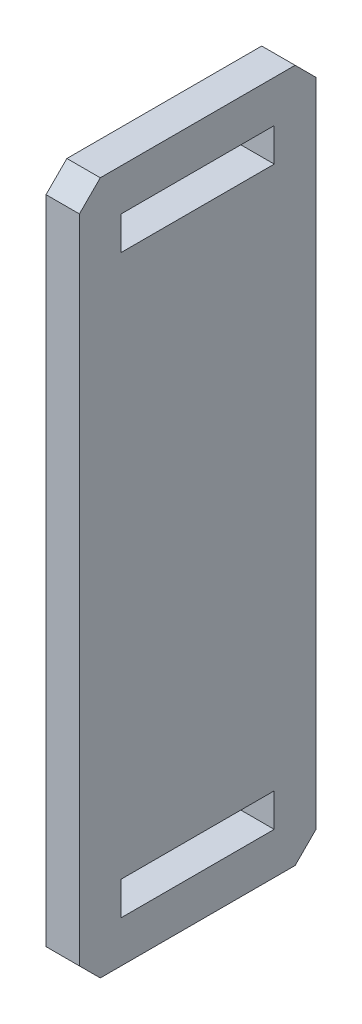
ISO-10303-21;
HEADER;
FILE_DESCRIPTION(('STEP AP214'),'2;1');
FILE_NAME('part.step','',(''),(''),'','','');
FILE_SCHEMA(('AUTOMOTIVE_DESIGN { 1 0 10303 214 1 1 1 1 }'));
ENDSEC;
DATA;
#1=APPLICATION_CONTEXT('core data for automotive mechanical design processes');
#2=APPLICATION_PROTOCOL_DEFINITION('international standard','automotive_design',2000,#1);
#3=PRODUCT_CONTEXT('',#1,'mechanical');
#4=PRODUCT('Part','Part','',(#3));
#5=PRODUCT_RELATED_PRODUCT_CATEGORY('part','',(#4));
#6=PRODUCT_DEFINITION_FORMATION('','',#4);
#7=PRODUCT_DEFINITION_CONTEXT('part definition',#1,'design');
#8=PRODUCT_DEFINITION('design','',#6,#7);
#9=PRODUCT_DEFINITION_SHAPE('','',#8);
#10=(LENGTH_UNIT() NAMED_UNIT(*) SI_UNIT(.MILLI.,.METRE.));
#11=(NAMED_UNIT(*) PLANE_ANGLE_UNIT() SI_UNIT($,.RADIAN.));
#12=(NAMED_UNIT(*) SI_UNIT($,.STERADIAN.) SOLID_ANGLE_UNIT());
#13=UNCERTAINTY_MEASURE_WITH_UNIT(LENGTH_MEASURE(1.E-05),#10,'distance_accuracy_value','');
#14=(GEOMETRIC_REPRESENTATION_CONTEXT(3) GLOBAL_UNCERTAINTY_ASSIGNED_CONTEXT((#13)) GLOBAL_UNIT_ASSIGNED_CONTEXT((#10,
#11,#12)) REPRESENTATION_CONTEXT('',''));
#15=CARTESIAN_POINT('',(0.,0.,0.));
#16=DIRECTION('',(0.,0.,1.));
#17=DIRECTION('',(1.,0.,0.));
#18=AXIS2_PLACEMENT_3D('',#15,#16,#17);
#19=CARTESIAN_POINT('',(3.048,0.,0.));
#20=DIRECTION('',(-1.,0.,0.));
#21=DIRECTION('',(0.,0.,1.));
#22=AXIS2_PLACEMENT_3D('',#19,#20,#21);
#23=PLANE('',#22);
#24=DIRECTION('',(0.,1.,0.));
#25=VECTOR('',#24,1.);
#26=CARTESIAN_POINT('',(3.048,55.626,97.0572928761086));
#27=LINE('',#26,#25);
#28=CARTESIAN_POINT('',(3.048,49.53,97.0572928761086));
#29=VERTEX_POINT('',#28);
#30=CARTESIAN_POINT('',(3.048,55.626,97.0572928761086));
#31=VERTEX_POINT('',#30);
#32=EDGE_CURVE('E190',#29,#31,#27,.T.);
#33=ORIENTED_EDGE('',*,*,#32,.F.);
#34=DIRECTION('',(0.,0.,-1.));
#35=VECTOR('',#34,1.);
#36=CARTESIAN_POINT('',(3.048,49.53,97.0572928761086));
#37=LINE('',#36,#35);
#38=CARTESIAN_POINT('',(3.048,49.53,124.997292876109));
#39=VERTEX_POINT('',#38);
#40=EDGE_CURVE('E198',#39,#29,#37,.T.);
#41=ORIENTED_EDGE('',*,*,#40,.F.);
#42=DIRECTION('',(0.,-1.,0.));
#43=VECTOR('',#42,1.);
#44=CARTESIAN_POINT('',(3.048,55.626,124.997292876109));
#45=LINE('',#44,#43);
#46=CARTESIAN_POINT('',(3.048,55.626,124.997292876109));
#47=VERTEX_POINT('',#46);
#48=EDGE_CURVE('E195',#47,#39,#45,.T.);
#49=ORIENTED_EDGE('',*,*,#48,.F.);
#50=DIRECTION('',(0.,0.,1.));
#51=VECTOR('',#50,1.);
#52=CARTESIAN_POINT('',(3.048,55.626,97.0572928761086));
#53=LINE('',#52,#51);
#54=EDGE_CURVE('E192',#31,#47,#53,.T.);
#55=ORIENTED_EDGE('',*,*,#54,.F.);
#56=EDGE_LOOP('',(#33,#41,#49,#55));
#57=FACE_BOUND('',#56,.T.);
#58=DIRECTION('',(0.,0.,-1.));
#59=VECTOR('',#58,1.);
#60=CARTESIAN_POINT('',(3.048,-63.246,89.4372928761086));
#61=LINE('',#60,#59);
#62=CARTESIAN_POINT('',(3.048,-63.246,128.807292876109));
#63=VERTEX_POINT('',#62);
#64=CARTESIAN_POINT('',(3.048,-63.246,93.2472928761086));
#65=VERTEX_POINT('',#64);
#66=EDGE_CURVE('E229',#63,#65,#61,.T.);
#67=ORIENTED_EDGE('',*,*,#66,.T.);
#68=DIRECTION('',(0.,-0.707106781186546,0.707106781186549));
#69=VECTOR('',#68,1.);
#70=CARTESIAN_POINT('',(3.048,-59.436,89.4372928761086));
#71=LINE('',#70,#69);
#72=CARTESIAN_POINT('',(3.048,-59.436,89.4372928761086));
#73=VERTEX_POINT('',#72);
#74=EDGE_CURVE('E264',#65,#73,#71,.F.);
#75=ORIENTED_EDGE('',*,*,#74,.T.);
#76=DIRECTION('',(0.,1.,0.));
#77=VECTOR('',#76,1.);
#78=CARTESIAN_POINT('',(3.048,63.246,89.4372928761086));
#79=LINE('',#78,#77);
#80=CARTESIAN_POINT('',(3.048,59.436,89.4372928761086));
#81=VERTEX_POINT('',#80);
#82=EDGE_CURVE('E221',#73,#81,#79,.T.);
#83=ORIENTED_EDGE('',*,*,#82,.T.);
#84=DIRECTION('',(0.,-0.707106781186549,-0.707106781186546));
#85=VECTOR('',#84,1.);
#86=CARTESIAN_POINT('',(3.048,63.246,93.2472928761086));
#87=LINE('',#86,#85);
#88=CARTESIAN_POINT('',(3.048,63.246,93.2472928761086));
#89=VERTEX_POINT('',#88);
#90=EDGE_CURVE('E260',#81,#89,#87,.F.);
#91=ORIENTED_EDGE('',*,*,#90,.T.);
#92=DIRECTION('',(0.,0.,1.));
#93=VECTOR('',#92,1.);
#94=CARTESIAN_POINT('',(3.048,63.246,89.4372928761086));
#95=LINE('',#94,#93);
#96=CARTESIAN_POINT('',(3.048,63.246,128.807292876109));
#97=VERTEX_POINT('',#96);
#98=EDGE_CURVE('E224',#89,#97,#95,.T.);
#99=ORIENTED_EDGE('',*,*,#98,.T.);
#100=DIRECTION('',(0.,0.707106781186545,-0.70710678118655));
#101=VECTOR('',#100,1.);
#102=CARTESIAN_POINT('',(3.048,59.436,132.617292876109));
#103=LINE('',#102,#101);
#104=CARTESIAN_POINT('',(3.048,59.436,132.617292876109));
#105=VERTEX_POINT('',#104);
#106=EDGE_CURVE('E55',#97,#105,#103,.F.);
#107=ORIENTED_EDGE('',*,*,#106,.T.);
#108=DIRECTION('',(0.,-1.,0.));
#109=VECTOR('',#108,1.);
#110=CARTESIAN_POINT('',(3.048,63.246,132.617292876109));
#111=LINE('',#110,#109);
#112=CARTESIAN_POINT('',(3.048,-59.436,132.617292876109));
#113=VERTEX_POINT('',#112);
#114=EDGE_CURVE('E227',#105,#113,#111,.T.);
#115=ORIENTED_EDGE('',*,*,#114,.T.);
#116=DIRECTION('',(0.,0.707106781186544,0.707106781186551));
#117=VECTOR('',#116,1.);
#118=CARTESIAN_POINT('',(3.048,-63.246,128.807292876109));
#119=LINE('',#118,#117);
#120=EDGE_CURVE('E262',#113,#63,#119,.F.);
#121=ORIENTED_EDGE('',*,*,#120,.T.);
#122=EDGE_LOOP('',(#67,#75,#83,#91,#99,#107,#115,#121));
#123=FACE_BOUND('',#122,.T.);
#124=DIRECTION('',(0.,1.,0.));
#125=VECTOR('',#124,1.);
#126=CARTESIAN_POINT('',(3.048,-49.53,97.0572928761086));
#127=LINE('',#126,#125);
#128=CARTESIAN_POINT('',(3.048,-55.626,97.0572928761086));
#129=VERTEX_POINT('',#128);
#130=CARTESIAN_POINT('',(3.048,-49.53,97.0572928761086));
#131=VERTEX_POINT('',#130);
#132=EDGE_CURVE('E149',#129,#131,#127,.T.);
#133=ORIENTED_EDGE('',*,*,#132,.F.);
#134=DIRECTION('',(0.,0.,-1.));
#135=VECTOR('',#134,1.);
#136=CARTESIAN_POINT('',(3.048,-55.626,97.0572928761086));
#137=LINE('',#136,#135);
#138=CARTESIAN_POINT('',(3.048,-55.626,124.997292876109));
#139=VERTEX_POINT('',#138);
#140=EDGE_CURVE('E174',#139,#129,#137,.T.);
#141=ORIENTED_EDGE('',*,*,#140,.F.);
#142=DIRECTION('',(0.,-1.,0.));
#143=VECTOR('',#142,1.);
#144=CARTESIAN_POINT('',(3.048,-49.53,124.997292876109));
#145=LINE('',#144,#143);
#146=CARTESIAN_POINT('',(3.048,-49.53,124.997292876109));
#147=VERTEX_POINT('',#146);
#148=EDGE_CURVE('E172',#147,#139,#145,.T.);
#149=ORIENTED_EDGE('',*,*,#148,.F.);
#150=DIRECTION('',(0.,0.,1.));
#151=VECTOR('',#150,1.);
#152=CARTESIAN_POINT('',(3.048,-49.53,97.0572928761086));
#153=LINE('',#152,#151);
#154=EDGE_CURVE('E159',#131,#147,#153,.T.);
#155=ORIENTED_EDGE('',*,*,#154,.F.);
#156=EDGE_LOOP('',(#133,#141,#149,#155));
#157=FACE_BOUND('',#156,.T.);
#158=ADVANCED_FACE('F33',(#57,#123,#157),#23,.F.);
#159=CARTESIAN_POINT('',(-3.048,0.,0.));
#160=DIRECTION('',(-1.,0.,0.));
#161=DIRECTION('',(0.,0.,1.));
#162=AXIS2_PLACEMENT_3D('',#159,#160,#161);
#163=PLANE('',#162);
#164=DIRECTION('',(0.,1.,0.));
#165=VECTOR('',#164,1.);
#166=CARTESIAN_POINT('',(-3.048,63.246,89.4372928761086));
#167=LINE('',#166,#165);
#168=CARTESIAN_POINT('',(-3.048,-59.436,89.4372928761086));
#169=VERTEX_POINT('',#168);
#170=CARTESIAN_POINT('',(-3.048,59.436,89.4372928761086));
#171=VERTEX_POINT('',#170);
#172=EDGE_CURVE('E220',#169,#171,#167,.T.);
#173=ORIENTED_EDGE('',*,*,#172,.F.);
#174=DIRECTION('',(0.,0.707106781186546,-0.707106781186549));
#175=VECTOR('',#174,1.);
#176=CARTESIAN_POINT('',(-3.048,15.0006464380542,15.0006464380541));
#177=LINE('',#176,#175);
#178=CARTESIAN_POINT('',(-3.048,-63.246,93.2472928761086));
#179=VERTEX_POINT('',#178);
#180=EDGE_CURVE('E252',#169,#179,#177,.F.);
#181=ORIENTED_EDGE('',*,*,#180,.T.);
#182=DIRECTION('',(0.,0.,-1.));
#183=VECTOR('',#182,1.);
#184=CARTESIAN_POINT('',(-3.048,-63.246,89.4372928761086));
#185=LINE('',#184,#183);
#186=CARTESIAN_POINT('',(-3.048,-63.246,128.807292876109));
#187=VERTEX_POINT('',#186);
#188=EDGE_CURVE('E225',#187,#179,#185,.T.);
#189=ORIENTED_EDGE('',*,*,#188,.F.);
#190=DIRECTION('',(0.,-0.707106781186544,-0.707106781186551));
#191=VECTOR('',#190,1.);
#192=CARTESIAN_POINT('',(-3.048,-96.0266464380547,96.0266464380536));
#193=LINE('',#192,#191);
#194=CARTESIAN_POINT('',(-3.048,-59.436,132.617292876109));
#195=VERTEX_POINT('',#194);
#196=EDGE_CURVE('E250',#187,#195,#193,.F.);
#197=ORIENTED_EDGE('',*,*,#196,.T.);
#198=DIRECTION('',(0.,-1.,0.));
#199=VECTOR('',#198,1.);
#200=CARTESIAN_POINT('',(-3.048,63.246,132.617292876109));
#201=LINE('',#200,#199);
#202=CARTESIAN_POINT('',(-3.048,59.436,132.617292876109));
#203=VERTEX_POINT('',#202);
#204=EDGE_CURVE('E238',#203,#195,#201,.T.);
#205=ORIENTED_EDGE('',*,*,#204,.F.);
#206=DIRECTION('',(0.,-0.707106781186545,0.70710678118655));
#207=VECTOR('',#206,1.);
#208=CARTESIAN_POINT('',(-3.048,96.0266464380545,96.0266464380538));
#209=LINE('',#208,#207);
#210=CARTESIAN_POINT('',(-3.048,63.246,128.807292876109));
#211=VERTEX_POINT('',#210);
#212=EDGE_CURVE('E246',#203,#211,#209,.F.);
#213=ORIENTED_EDGE('',*,*,#212,.T.);
#214=DIRECTION('',(0.,0.,1.));
#215=VECTOR('',#214,1.);
#216=CARTESIAN_POINT('',(-3.048,63.246,89.4372928761086));
#217=LINE('',#216,#215);
#218=CARTESIAN_POINT('',(-3.048,63.246,93.2472928761086));
#219=VERTEX_POINT('',#218);
#220=EDGE_CURVE('E235',#219,#211,#217,.T.);
#221=ORIENTED_EDGE('',*,*,#220,.F.);
#222=DIRECTION('',(0.,0.707106781186549,0.707106781186546));
#223=VECTOR('',#222,1.);
#224=CARTESIAN_POINT('',(-3.048,-15.0006464380545,15.0006464380546));
#225=LINE('',#224,#223);
#226=EDGE_CURVE('E248',#219,#171,#225,.F.);
#227=ORIENTED_EDGE('',*,*,#226,.T.);
#228=EDGE_LOOP('',(#173,#181,#189,#197,#205,#213,#221,#227));
#229=FACE_BOUND('',#228,.T.);
#230=DIRECTION('',(0.,0.,-1.));
#231=VECTOR('',#230,1.);
#232=CARTESIAN_POINT('',(-3.048,49.53,97.0572928761086));
#233=LINE('',#232,#231);
#234=CARTESIAN_POINT('',(-3.048,49.53,124.997292876109));
#235=VERTEX_POINT('',#234);
#236=CARTESIAN_POINT('',(-3.048,49.53,97.0572928761086));
#237=VERTEX_POINT('',#236);
#238=EDGE_CURVE('E193',#235,#237,#233,.T.);
#239=ORIENTED_EDGE('',*,*,#238,.T.);
#240=DIRECTION('',(0.,1.,0.));
#241=VECTOR('',#240,1.);
#242=CARTESIAN_POINT('',(-3.048,55.626,97.0572928761086));
#243=LINE('',#242,#241);
#244=CARTESIAN_POINT('',(-3.048,55.626,97.0572928761086));
#245=VERTEX_POINT('',#244);
#246=EDGE_CURVE('E167',#237,#245,#243,.T.);
#247=ORIENTED_EDGE('',*,*,#246,.T.);
#248=DIRECTION('',(0.,0.,1.));
#249=VECTOR('',#248,1.);
#250=CARTESIAN_POINT('',(-3.048,55.626,97.0572928761086));
#251=LINE('',#250,#249);
#252=CARTESIAN_POINT('',(-3.048,55.626,124.997292876109));
#253=VERTEX_POINT('',#252);
#254=EDGE_CURVE('E203',#245,#253,#251,.T.);
#255=ORIENTED_EDGE('',*,*,#254,.T.);
#256=DIRECTION('',(0.,-1.,0.));
#257=VECTOR('',#256,1.);
#258=CARTESIAN_POINT('',(-3.048,55.626,124.997292876109));
#259=LINE('',#258,#257);
#260=EDGE_CURVE('E206',#253,#235,#259,.T.);
#261=ORIENTED_EDGE('',*,*,#260,.T.);
#262=EDGE_LOOP('',(#239,#247,#255,#261));
#263=FACE_BOUND('',#262,.T.);
#264=DIRECTION('',(0.,0.,-1.));
#265=VECTOR('',#264,1.);
#266=CARTESIAN_POINT('',(-3.048,-55.626,97.0572928761086));
#267=LINE('',#266,#265);
#268=CARTESIAN_POINT('',(-3.048,-55.626,124.997292876109));
#269=VERTEX_POINT('',#268);
#270=CARTESIAN_POINT('',(-3.048,-55.626,97.0572928761086));
#271=VERTEX_POINT('',#270);
#272=EDGE_CURVE('E160',#269,#271,#267,.T.);
#273=ORIENTED_EDGE('',*,*,#272,.T.);
#274=DIRECTION('',(0.,1.,0.));
#275=VECTOR('',#274,1.);
#276=CARTESIAN_POINT('',(-3.048,-49.53,97.0572928761086));
#277=LINE('',#276,#275);
#278=CARTESIAN_POINT('',(-3.048,-49.53,97.0572928761086));
#279=VERTEX_POINT('',#278);
#280=EDGE_CURVE('E178',#271,#279,#277,.T.);
#281=ORIENTED_EDGE('',*,*,#280,.T.);
#282=DIRECTION('',(0.,0.,1.));
#283=VECTOR('',#282,1.);
#284=CARTESIAN_POINT('',(-3.048,-49.53,97.0572928761086));
#285=LINE('',#284,#283);
#286=CARTESIAN_POINT('',(-3.048,-49.53,124.997292876109));
#287=VERTEX_POINT('',#286);
#288=EDGE_CURVE('E166',#279,#287,#285,.T.);
#289=ORIENTED_EDGE('',*,*,#288,.T.);
#290=DIRECTION('',(0.,-1.,0.));
#291=VECTOR('',#290,1.);
#292=CARTESIAN_POINT('',(-3.048,-49.53,124.997292876109));
#293=LINE('',#292,#291);
#294=EDGE_CURVE('E181',#287,#269,#293,.T.);
#295=ORIENTED_EDGE('',*,*,#294,.T.);
#296=EDGE_LOOP('',(#273,#281,#289,#295));
#297=FACE_BOUND('',#296,.T.);
#298=ADVANCED_FACE('F282',(#229,#263,#297),#163,.T.);
#299=CARTESIAN_POINT('',(3.048,63.246,89.4372928761086));
#300=DIRECTION('',(0.,0.,1.));
#301=DIRECTION('',(0.,-1.,0.));
#302=AXIS2_PLACEMENT_3D('',#299,#300,#301);
#303=PLANE('',#302);
#304=ORIENTED_EDGE('',*,*,#82,.F.);
#305=DIRECTION('',(-1.,0.,0.));
#306=VECTOR('',#305,1.);
#307=CARTESIAN_POINT('',(3.048,-59.436,89.4372928761086));
#308=LINE('',#307,#306);
#309=EDGE_CURVE('E243',#73,#169,#308,.T.);
#310=ORIENTED_EDGE('',*,*,#309,.T.);
#311=ORIENTED_EDGE('',*,*,#172,.T.);
#312=DIRECTION('',(1.,0.,0.));
#313=VECTOR('',#312,1.);
#314=CARTESIAN_POINT('',(3.048,59.436,89.4372928761086));
#315=LINE('',#314,#313);
#316=EDGE_CURVE('E232',#171,#81,#315,.T.);
#317=ORIENTED_EDGE('',*,*,#316,.T.);
#318=EDGE_LOOP('',(#304,#310,#311,#317));
#319=FACE_BOUND('',#318,.T.);
#320=ADVANCED_FACE('F299',(#319),#303,.F.);
#321=CARTESIAN_POINT('',(3.048,63.246,89.4372928761086));
#322=DIRECTION('',(0.,-1.,0.));
#323=DIRECTION('',(0.,0.,-1.));
#324=AXIS2_PLACEMENT_3D('',#321,#322,#323);
#325=PLANE('',#324);
#326=ORIENTED_EDGE('',*,*,#98,.F.);
#327=DIRECTION('',(-1.,0.,0.));
#328=VECTOR('',#327,1.);
#329=CARTESIAN_POINT('',(3.048,63.246,93.2472928761086));
#330=LINE('',#329,#328);
#331=EDGE_CURVE('E11',#89,#219,#330,.T.);
#332=ORIENTED_EDGE('',*,*,#331,.T.);
#333=ORIENTED_EDGE('',*,*,#220,.T.);
#334=DIRECTION('',(1.,0.,0.));
#335=VECTOR('',#334,1.);
#336=CARTESIAN_POINT('',(3.048,63.246,128.807292876109));
#337=LINE('',#336,#335);
#338=EDGE_CURVE('E41',#211,#97,#337,.T.);
#339=ORIENTED_EDGE('',*,*,#338,.T.);
#340=EDGE_LOOP('',(#326,#332,#333,#339));
#341=FACE_BOUND('',#340,.T.);
#342=ADVANCED_FACE('F272',(#341),#325,.F.);
#343=CARTESIAN_POINT('',(3.048,63.246,132.617292876109));
#344=DIRECTION('',(0.,0.,-1.));
#345=DIRECTION('',(-1.,0.,0.));
#346=AXIS2_PLACEMENT_3D('',#343,#344,#345);
#347=PLANE('',#346);
#348=ORIENTED_EDGE('',*,*,#204,.T.);
#349=DIRECTION('',(1.,0.,0.));
#350=VECTOR('',#349,1.);
#351=CARTESIAN_POINT('',(3.048,-59.436,132.617292876109));
#352=LINE('',#351,#350);
#353=EDGE_CURVE('E48',#195,#113,#352,.T.);
#354=ORIENTED_EDGE('',*,*,#353,.T.);
#355=ORIENTED_EDGE('',*,*,#114,.F.);
#356=DIRECTION('',(-1.,0.,0.));
#357=VECTOR('',#356,1.);
#358=CARTESIAN_POINT('',(3.048,59.436,132.617292876109));
#359=LINE('',#358,#357);
#360=EDGE_CURVE('E266',#105,#203,#359,.T.);
#361=ORIENTED_EDGE('',*,*,#360,.T.);
#362=EDGE_LOOP('',(#348,#354,#355,#361));
#363=FACE_BOUND('',#362,.T.);
#364=ADVANCED_FACE('F279',(#363),#347,.F.);
#365=CARTESIAN_POINT('',(3.048,-63.246,89.4372928761086));
#366=DIRECTION('',(0.,1.,0.));
#367=DIRECTION('',(0.,0.,1.));
#368=AXIS2_PLACEMENT_3D('',#365,#366,#367);
#369=PLANE('',#368);
#370=ORIENTED_EDGE('',*,*,#188,.T.);
#371=DIRECTION('',(1.,0.,0.));
#372=VECTOR('',#371,1.);
#373=CARTESIAN_POINT('',(3.048,-63.246,93.2472928761086));
#374=LINE('',#373,#372);
#375=EDGE_CURVE('E257',#179,#65,#374,.T.);
#376=ORIENTED_EDGE('',*,*,#375,.T.);
#377=ORIENTED_EDGE('',*,*,#66,.F.);
#378=DIRECTION('',(-1.,0.,0.));
#379=VECTOR('',#378,1.);
#380=CARTESIAN_POINT('',(3.048,-63.246,128.807292876109));
#381=LINE('',#380,#379);
#382=EDGE_CURVE('E254',#63,#187,#381,.T.);
#383=ORIENTED_EDGE('',*,*,#382,.T.);
#384=EDGE_LOOP('',(#370,#376,#377,#383));
#385=FACE_BOUND('',#384,.T.);
#386=ADVANCED_FACE('F291',(#385),#369,.F.);
#387=CARTESIAN_POINT('',(3.048,55.626,97.0572928761086));
#388=DIRECTION('',(0.,0.,1.));
#389=DIRECTION('',(1.,0.,0.));
#390=AXIS2_PLACEMENT_3D('',#387,#388,#389);
#391=PLANE('',#390);
#392=ORIENTED_EDGE('',*,*,#246,.F.);
#393=DIRECTION('',(-1.,0.,0.));
#394=VECTOR('',#393,1.);
#395=CARTESIAN_POINT('',(3.048,49.53,97.0572928761086));
#396=LINE('',#395,#394);
#397=EDGE_CURVE('E200',#29,#237,#396,.T.);
#398=ORIENTED_EDGE('',*,*,#397,.F.);
#399=ORIENTED_EDGE('',*,*,#32,.T.);
#400=DIRECTION('',(-1.,0.,0.));
#401=VECTOR('',#400,1.);
#402=CARTESIAN_POINT('',(3.048,55.626,97.0572928761086));
#403=LINE('',#402,#401);
#404=EDGE_CURVE('E217',#31,#245,#403,.T.);
#405=ORIENTED_EDGE('',*,*,#404,.T.);
#406=EDGE_LOOP('',(#392,#398,#399,#405));
#407=FACE_BOUND('',#406,.T.);
#408=ADVANCED_FACE('F318',(#407),#391,.T.);
#409=CARTESIAN_POINT('',(3.048,55.626,97.0572928761086));
#410=DIRECTION('',(0.,-1.,0.));
#411=DIRECTION('',(0.,0.,-1.));
#412=AXIS2_PLACEMENT_3D('',#409,#410,#411);
#413=PLANE('',#412);
#414=ORIENTED_EDGE('',*,*,#254,.F.);
#415=ORIENTED_EDGE('',*,*,#404,.F.);
#416=ORIENTED_EDGE('',*,*,#54,.T.);
#417=DIRECTION('',(-1.,0.,0.));
#418=VECTOR('',#417,1.);
#419=CARTESIAN_POINT('',(3.048,55.626,124.997292876109));
#420=LINE('',#419,#418);
#421=EDGE_CURVE('E215',#47,#253,#420,.T.);
#422=ORIENTED_EDGE('',*,*,#421,.T.);
#423=EDGE_LOOP('',(#414,#415,#416,#422));
#424=FACE_BOUND('',#423,.T.);
#425=ADVANCED_FACE('F354',(#424),#413,.T.);
#426=CARTESIAN_POINT('',(3.048,55.626,124.997292876109));
#427=DIRECTION('',(0.,0.,-1.));
#428=DIRECTION('',(-1.,0.,0.));
#429=AXIS2_PLACEMENT_3D('',#426,#427,#428);
#430=PLANE('',#429);
#431=ORIENTED_EDGE('',*,*,#260,.F.);
#432=ORIENTED_EDGE('',*,*,#421,.F.);
#433=ORIENTED_EDGE('',*,*,#48,.T.);
#434=DIRECTION('',(-1.,0.,0.));
#435=VECTOR('',#434,1.);
#436=CARTESIAN_POINT('',(3.048,49.53,124.997292876109));
#437=LINE('',#436,#435);
#438=EDGE_CURVE('E213',#39,#235,#437,.T.);
#439=ORIENTED_EDGE('',*,*,#438,.T.);
#440=EDGE_LOOP('',(#431,#432,#433,#439));
#441=FACE_BOUND('',#440,.T.);
#442=ADVANCED_FACE('F351',(#441),#430,.T.);
#443=CARTESIAN_POINT('',(3.048,49.53,97.0572928761086));
#444=DIRECTION('',(0.,1.,0.));
#445=DIRECTION('',(0.,0.,1.));
#446=AXIS2_PLACEMENT_3D('',#443,#444,#445);
#447=PLANE('',#446);
#448=ORIENTED_EDGE('',*,*,#238,.F.);
#449=ORIENTED_EDGE('',*,*,#438,.F.);
#450=ORIENTED_EDGE('',*,*,#40,.T.);
#451=ORIENTED_EDGE('',*,*,#397,.T.);
#452=EDGE_LOOP('',(#448,#449,#450,#451));
#453=FACE_BOUND('',#452,.T.);
#454=ADVANCED_FACE('F348',(#453),#447,.T.);
#455=CARTESIAN_POINT('',(3.048,-49.53,97.0572928761086));
#456=DIRECTION('',(0.,0.,1.));
#457=DIRECTION('',(1.,0.,0.));
#458=AXIS2_PLACEMENT_3D('',#455,#456,#457);
#459=PLANE('',#458);
#460=ORIENTED_EDGE('',*,*,#280,.F.);
#461=DIRECTION('',(-1.,0.,0.));
#462=VECTOR('',#461,1.);
#463=CARTESIAN_POINT('',(3.048,-55.626,97.0572928761086));
#464=LINE('',#463,#462);
#465=EDGE_CURVE('E155',#129,#271,#464,.T.);
#466=ORIENTED_EDGE('',*,*,#465,.F.);
#467=ORIENTED_EDGE('',*,*,#132,.T.);
#468=DIRECTION('',(-1.,0.,0.));
#469=VECTOR('',#468,1.);
#470=CARTESIAN_POINT('',(3.048,-49.53,97.0572928761086));
#471=LINE('',#470,#469);
#472=EDGE_CURVE('E152',#131,#279,#471,.T.);
#473=ORIENTED_EDGE('',*,*,#472,.T.);
#474=EDGE_LOOP('',(#460,#466,#467,#473));
#475=FACE_BOUND('',#474,.T.);
#476=ADVANCED_FACE('F151',(#475),#459,.T.);
#477=CARTESIAN_POINT('',(3.048,-49.53,97.0572928761086));
#478=DIRECTION('',(0.,-1.,0.));
#479=DIRECTION('',(0.,0.,-1.));
#480=AXIS2_PLACEMENT_3D('',#477,#478,#479);
#481=PLANE('',#480);
#482=ORIENTED_EDGE('',*,*,#288,.F.);
#483=ORIENTED_EDGE('',*,*,#472,.F.);
#484=ORIENTED_EDGE('',*,*,#154,.T.);
#485=DIRECTION('',(-1.,0.,0.));
#486=VECTOR('',#485,1.);
#487=CARTESIAN_POINT('',(3.048,-49.53,124.997292876109));
#488=LINE('',#487,#486);
#489=EDGE_CURVE('E168',#147,#287,#488,.T.);
#490=ORIENTED_EDGE('',*,*,#489,.T.);
#491=EDGE_LOOP('',(#482,#483,#484,#490));
#492=FACE_BOUND('',#491,.T.);
#493=ADVANCED_FACE('F163',(#492),#481,.T.);
#494=CARTESIAN_POINT('',(3.048,-49.53,124.997292876109));
#495=DIRECTION('',(0.,0.,-1.));
#496=DIRECTION('',(-1.,0.,0.));
#497=AXIS2_PLACEMENT_3D('',#494,#495,#496);
#498=PLANE('',#497);
#499=ORIENTED_EDGE('',*,*,#294,.F.);
#500=ORIENTED_EDGE('',*,*,#489,.F.);
#501=ORIENTED_EDGE('',*,*,#148,.T.);
#502=DIRECTION('',(-1.,0.,0.));
#503=VECTOR('',#502,1.);
#504=CARTESIAN_POINT('',(3.048,-55.626,124.997292876109));
#505=LINE('',#504,#503);
#506=EDGE_CURVE('E187',#139,#269,#505,.T.);
#507=ORIENTED_EDGE('',*,*,#506,.T.);
#508=EDGE_LOOP('',(#499,#500,#501,#507));
#509=FACE_BOUND('',#508,.T.);
#510=ADVANCED_FACE('F334',(#509),#498,.T.);
#511=CARTESIAN_POINT('',(3.048,-55.626,97.0572928761086));
#512=DIRECTION('',(0.,1.,0.));
#513=DIRECTION('',(0.,0.,1.));
#514=AXIS2_PLACEMENT_3D('',#511,#512,#513);
#515=PLANE('',#514);
#516=ORIENTED_EDGE('',*,*,#272,.F.);
#517=ORIENTED_EDGE('',*,*,#506,.F.);
#518=ORIENTED_EDGE('',*,*,#140,.T.);
#519=ORIENTED_EDGE('',*,*,#465,.T.);
#520=EDGE_LOOP('',(#516,#517,#518,#519));
#521=FACE_BOUND('',#520,.T.);
#522=ADVANCED_FACE('F330',(#521),#515,.T.);
#523=CARTESIAN_POINT('',(3.048,-59.436,89.4372928761086));
#524=DIRECTION('',(0.,0.707106781186549,0.707106781186546));
#525=DIRECTION('',(-1.,0.,0.));
#526=AXIS2_PLACEMENT_3D('',#523,#524,#525);
#527=PLANE('',#526);
#528=ORIENTED_EDGE('',*,*,#74,.F.);
#529=ORIENTED_EDGE('',*,*,#375,.F.);
#530=ORIENTED_EDGE('',*,*,#180,.F.);
#531=ORIENTED_EDGE('',*,*,#309,.F.);
#532=EDGE_LOOP('',(#528,#529,#530,#531));
#533=FACE_BOUND('',#532,.T.);
#534=ADVANCED_FACE('F297',(#533),#527,.F.);
#535=CARTESIAN_POINT('',(3.048,-63.246,128.807292876109));
#536=DIRECTION('',(0.,0.707106781186551,-0.707106781186544));
#537=DIRECTION('',(-1.,0.,0.));
#538=AXIS2_PLACEMENT_3D('',#535,#536,#537);
#539=PLANE('',#538);
#540=ORIENTED_EDGE('',*,*,#120,.F.);
#541=ORIENTED_EDGE('',*,*,#353,.F.);
#542=ORIENTED_EDGE('',*,*,#196,.F.);
#543=ORIENTED_EDGE('',*,*,#382,.F.);
#544=EDGE_LOOP('',(#540,#541,#542,#543));
#545=FACE_BOUND('',#544,.T.);
#546=ADVANCED_FACE('F288',(#545),#539,.F.);
#547=CARTESIAN_POINT('',(3.048,63.246,93.2472928761086));
#548=DIRECTION('',(0.,-0.707106781186546,0.707106781186549));
#549=DIRECTION('',(-1.,0.,0.));
#550=AXIS2_PLACEMENT_3D('',#547,#548,#549);
#551=PLANE('',#550);
#552=ORIENTED_EDGE('',*,*,#90,.F.);
#553=ORIENTED_EDGE('',*,*,#316,.F.);
#554=ORIENTED_EDGE('',*,*,#226,.F.);
#555=ORIENTED_EDGE('',*,*,#331,.F.);
#556=EDGE_LOOP('',(#552,#553,#554,#555));
#557=FACE_BOUND('',#556,.T.);
#558=ADVANCED_FACE('F302',(#557),#551,.F.);
#559=CARTESIAN_POINT('',(3.048,59.436,132.617292876109));
#560=DIRECTION('',(0.,-0.70710678118655,-0.707106781186545));
#561=DIRECTION('',(-1.,0.,0.));
#562=AXIS2_PLACEMENT_3D('',#559,#560,#561);
#563=PLANE('',#562);
#564=ORIENTED_EDGE('',*,*,#106,.F.);
#565=ORIENTED_EDGE('',*,*,#338,.F.);
#566=ORIENTED_EDGE('',*,*,#212,.F.);
#567=ORIENTED_EDGE('',*,*,#360,.F.);
#568=EDGE_LOOP('',(#564,#565,#566,#567));
#569=FACE_BOUND('',#568,.T.);
#570=ADVANCED_FACE('F35',(#569),#563,.F.);
#571=CLOSED_SHELL('',(#158,#298,#320,#342,#364,#386,#408,#425,#442,#454,#476,#493,#510,#522,
#534,#546,#558,#570));
#572=MANIFOLD_SOLID_BREP('B2',#571);
#573=ADVANCED_BREP_SHAPE_REPRESENTATION('',(#18,#572),#14);
#574=SHAPE_DEFINITION_REPRESENTATION(#9,#573);
ENDSEC;
END-ISO-10303-21;
